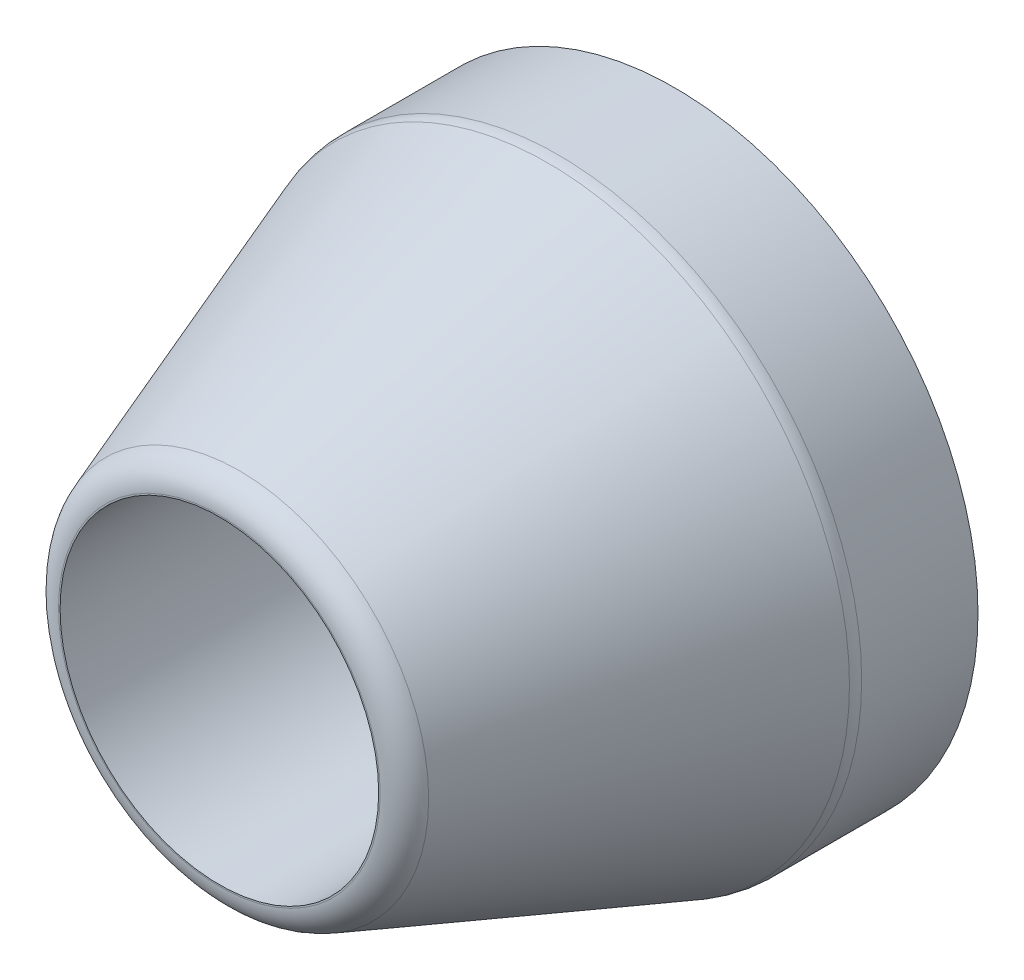
ISO-10303-21;
HEADER;
FILE_DESCRIPTION(('STEP AP214'),'2;1');
FILE_NAME('part.step','',(''),(''),'','','');
FILE_SCHEMA(('AUTOMOTIVE_DESIGN { 1 0 10303 214 1 1 1 1 }'));
ENDSEC;
DATA;
#1=APPLICATION_CONTEXT('core data for automotive mechanical design processes');
#2=APPLICATION_PROTOCOL_DEFINITION('international standard','automotive_design',2000,#1);
#3=PRODUCT_CONTEXT('',#1,'mechanical');
#4=PRODUCT('Part','Part','',(#3));
#5=PRODUCT_RELATED_PRODUCT_CATEGORY('part','',(#4));
#6=PRODUCT_DEFINITION_FORMATION('','',#4);
#7=PRODUCT_DEFINITION_CONTEXT('part definition',#1,'design');
#8=PRODUCT_DEFINITION('design','',#6,#7);
#9=PRODUCT_DEFINITION_SHAPE('','',#8);
#10=(LENGTH_UNIT() NAMED_UNIT(*) SI_UNIT(.MILLI.,.METRE.));
#11=(NAMED_UNIT(*) PLANE_ANGLE_UNIT() SI_UNIT($,.RADIAN.));
#12=(NAMED_UNIT(*) SI_UNIT($,.STERADIAN.) SOLID_ANGLE_UNIT());
#13=UNCERTAINTY_MEASURE_WITH_UNIT(LENGTH_MEASURE(1.E-05),#10,'distance_accuracy_value','');
#14=(GEOMETRIC_REPRESENTATION_CONTEXT(3) GLOBAL_UNCERTAINTY_ASSIGNED_CONTEXT((#13)) GLOBAL_UNIT_ASSIGNED_CONTEXT((#10,
#11,#12)) REPRESENTATION_CONTEXT('',''));
#15=CARTESIAN_POINT('',(0.,0.,0.));
#16=DIRECTION('',(0.,0.,1.));
#17=DIRECTION('',(1.,0.,0.));
#18=AXIS2_PLACEMENT_3D('',#15,#16,#17);
#19=CARTESIAN_POINT('',(0.,0.,0.));
#20=DIRECTION('',(0.,0.,1.));
#21=DIRECTION('',(1.,0.,0.));
#22=AXIS2_PLACEMENT_3D('',#19,#20,#21);
#23=CYLINDRICAL_SURFACE('',#22,2.);
#24=CARTESIAN_POINT('',(0.,0.,2.00000000000002));
#25=DIRECTION('',(0.,0.,1.));
#26=DIRECTION('',(1.,0.,0.));
#27=AXIS2_PLACEMENT_3D('',#24,#25,#26);
#28=CIRCLE('',#27,2.);
#29=CARTESIAN_POINT('',(2.,0.,2.00000000000002));
#30=VERTEX_POINT('',#29);
#31=EDGE_CURVE('E57',#30,#30,#28,.F.);
#32=ORIENTED_EDGE('',*,*,#31,.T.);
#33=EDGE_LOOP('',(#32));
#34=FACE_BOUND('',#33,.T.);
#35=CARTESIAN_POINT('',(0.,0.,7.));
#36=DIRECTION('',(0.,0.,1.));
#37=DIRECTION('',(1.,0.,0.));
#38=AXIS2_PLACEMENT_3D('',#35,#36,#37);
#39=CIRCLE('',#38,2.);
#40=CARTESIAN_POINT('',(2.,0.,7.));
#41=VERTEX_POINT('',#40);
#42=EDGE_CURVE('E64',#41,#41,#39,.F.);
#43=ORIENTED_EDGE('',*,*,#42,.F.);
#44=EDGE_LOOP('',(#43));
#45=FACE_BOUND('',#44,.T.);
#46=ADVANCED_FACE('F37',(#34,#45),#23,.F.);
#47=CARTESIAN_POINT('',(0.,0.,15.));
#48=DIRECTION('',(0.,0.,-1.));
#49=DIRECTION('',(-1.,0.,0.));
#50=AXIS2_PLACEMENT_3D('',#47,#48,#49);
#51=CYLINDRICAL_SURFACE('',#50,10.);
#52=CARTESIAN_POINT('',(0.,0.,3.83376334147306));
#53=DIRECTION('',(0.,0.,1.));
#54=DIRECTION('',(1.,0.,0.));
#55=AXIS2_PLACEMENT_3D('',#52,#53,#54);
#56=CIRCLE('',#55,10.);
#57=CARTESIAN_POINT('',(10.,0.,3.83376334147306));
#58=VERTEX_POINT('',#57);
#59=EDGE_CURVE('E52',#58,#58,#56,.F.);
#60=ORIENTED_EDGE('',*,*,#59,.T.);
#61=EDGE_LOOP('',(#60));
#62=FACE_BOUND('',#61,.T.);
#63=CARTESIAN_POINT('',(0.,0.,0.));
#64=DIRECTION('',(0.,0.,1.));
#65=DIRECTION('',(1.,0.,0.));
#66=AXIS2_PLACEMENT_3D('',#63,#64,#65);
#67=CIRCLE('',#66,10.);
#68=CARTESIAN_POINT('',(10.,0.,0.));
#69=VERTEX_POINT('',#68);
#70=EDGE_CURVE('E63',#69,#69,#67,.T.);
#71=ORIENTED_EDGE('',*,*,#70,.T.);
#72=EDGE_LOOP('',(#71));
#73=FACE_BOUND('',#72,.T.);
#74=ADVANCED_FACE('F89',(#62,#73),#51,.T.);
#75=CARTESIAN_POINT('',(0.,0.,15.));
#76=DIRECTION('',(0.,0.,1.));
#77=DIRECTION('',(1.,0.,0.));
#78=AXIS2_PLACEMENT_3D('',#75,#76,#77);
#79=PLANE('',#78);
#80=CARTESIAN_POINT('',(0.,0.,15.));
#81=DIRECTION('',(0.,0.,1.));
#82=DIRECTION('',(1.,0.,0.));
#83=AXIS2_PLACEMENT_3D('',#80,#81,#82);
#84=CIRCLE('',#83,5.29979246179029);
#85=CARTESIAN_POINT('',(5.29979246179029,0.,15.));
#86=VERTEX_POINT('',#85);
#87=EDGE_CURVE('E10',#86,#86,#84,.T.);
#88=ORIENTED_EDGE('',*,*,#87,.T.);
#89=EDGE_LOOP('',(#88));
#90=FACE_BOUND('',#89,.T.);
#91=CARTESIAN_POINT('',(0.,0.,15.));
#92=DIRECTION('',(0.,0.,1.));
#93=DIRECTION('',(1.,0.,0.));
#94=AXIS2_PLACEMENT_3D('',#91,#92,#93);
#95=CIRCLE('',#94,5.25);
#96=CARTESIAN_POINT('',(5.25,0.,15.));
#97=VERTEX_POINT('',#96);
#98=EDGE_CURVE('E70',#97,#97,#95,.T.);
#99=ORIENTED_EDGE('',*,*,#98,.F.);
#100=EDGE_LOOP('',(#99));
#101=FACE_BOUND('',#100,.T.);
#102=ADVANCED_FACE('F86',(#90,#101),#79,.T.);
#103=CARTESIAN_POINT('',(0.,0.,0.));
#104=DIRECTION('',(0.,0.,1.));
#105=DIRECTION('',(1.,0.,0.));
#106=AXIS2_PLACEMENT_3D('',#103,#104,#105);
#107=PLANE('',#106);
#108=CARTESIAN_POINT('',(0.,0.,0.));
#109=DIRECTION('',(0.,0.,1.));
#110=DIRECTION('',(1.,0.,0.));
#111=AXIS2_PLACEMENT_3D('',#108,#109,#110);
#112=CIRCLE('',#111,4.00000000000001);
#113=CARTESIAN_POINT('',(4.00000000000001,0.,0.));
#114=VERTEX_POINT('',#113);
#115=EDGE_CURVE('E60',#114,#114,#112,.T.);
#116=ORIENTED_EDGE('',*,*,#115,.T.);
#117=EDGE_LOOP('',(#116));
#118=FACE_BOUND('',#117,.T.);
#119=ORIENTED_EDGE('',*,*,#70,.F.);
#120=EDGE_LOOP('',(#119));
#121=FACE_BOUND('',#120,.T.);
#122=ADVANCED_FACE('F88',(#118,#121),#107,.F.);
#123=CARTESIAN_POINT('',(0.,0.,7.));
#124=DIRECTION('',(0.,0.,1.));
#125=DIRECTION('',(1.,0.,0.));
#126=AXIS2_PLACEMENT_3D('',#123,#124,#125);
#127=PLANE('',#126);
#128=CARTESIAN_POINT('',(0.,0.,7.));
#129=DIRECTION('',(0.,0.,1.));
#130=DIRECTION('',(1.,0.,0.));
#131=AXIS2_PLACEMENT_3D('',#128,#129,#130);
#132=CIRCLE('',#131,5.25);
#133=CARTESIAN_POINT('',(5.25,0.,7.));
#134=VERTEX_POINT('',#133);
#135=EDGE_CURVE('E67',#134,#134,#132,.T.);
#136=ORIENTED_EDGE('',*,*,#135,.T.);
#137=EDGE_LOOP('',(#136));
#138=FACE_BOUND('',#137,.T.);
#139=ORIENTED_EDGE('',*,*,#42,.T.);
#140=EDGE_LOOP('',(#139));
#141=FACE_BOUND('',#140,.T.);
#142=ADVANCED_FACE('F76',(#138,#141),#127,.T.);
#143=CARTESIAN_POINT('',(0.,0.,7.));
#144=DIRECTION('',(0.,0.,1.));
#145=DIRECTION('',(1.,0.,0.));
#146=AXIS2_PLACEMENT_3D('',#143,#144,#145);
#147=CYLINDRICAL_SURFACE('',#146,5.25);
#148=ORIENTED_EDGE('',*,*,#135,.F.);
#149=EDGE_LOOP('',(#148));
#150=FACE_BOUND('',#149,.T.);
#151=ORIENTED_EDGE('',*,*,#98,.T.);
#152=EDGE_LOOP('',(#151));
#153=FACE_BOUND('',#152,.T.);
#154=ADVANCED_FACE('F79',(#150,#153),#147,.F.);
#155=CARTESIAN_POINT('',(0.,0.,15.));
#156=DIRECTION('',(0.,0.,-1.));
#157=DIRECTION('',(-1.,0.,0.));
#158=AXIS2_PLACEMENT_3D('',#155,#156,#157);
#159=CONICAL_SURFACE('',#158,6.,0.349065850398867);
#160=CARTESIAN_POINT('',(0.,0.,4.17578348479873));
#161=DIRECTION('',(0.,0.,-1.));
#162=DIRECTION('',(-1.,0.,0.));
#163=AXIS2_PLACEMENT_3D('',#160,#161,#162);
#164=CIRCLE('',#163,9.93969262078591);
#165=CARTESIAN_POINT('',(-9.93969262078591,0.,4.17578348479873));
#166=VERTEX_POINT('',#165);
#167=EDGE_CURVE('E44',#166,#166,#164,.F.);
#168=ORIENTED_EDGE('',*,*,#167,.T.);
#169=EDGE_LOOP('',(#168));
#170=FACE_BOUND('',#169,.T.);
#171=CARTESIAN_POINT('',(0.,0.,14.3420201433257));
#172=DIRECTION('',(0.,0.,1.));
#173=DIRECTION('',(1.,0.,0.));
#174=AXIS2_PLACEMENT_3D('',#171,#172,#173);
#175=CIRCLE('',#174,6.2394850825762);
#176=CARTESIAN_POINT('',(6.2394850825762,0.,14.3420201433257));
#177=VERTEX_POINT('',#176);
#178=EDGE_CURVE('E48',#177,#177,#175,.F.);
#179=ORIENTED_EDGE('',*,*,#178,.T.);
#180=EDGE_LOOP('',(#179));
#181=FACE_BOUND('',#180,.T.);
#182=ADVANCED_FACE('F82',(#170,#181),#159,.T.);
#183=CARTESIAN_POINT('',(0.,0.,0.));
#184=DIRECTION('',(0.,0.,-1.));
#185=DIRECTION('',(-1.,0.,0.));
#186=AXIS2_PLACEMENT_3D('',#183,#184,#185);
#187=CONICAL_SURFACE('',#186,4.00000000000001,0.785398163397446);
#188=ORIENTED_EDGE('',*,*,#31,.F.);
#189=EDGE_LOOP('',(#188));
#190=FACE_BOUND('',#189,.T.);
#191=ORIENTED_EDGE('',*,*,#115,.F.);
#192=EDGE_LOOP('',(#191));
#193=FACE_BOUND('',#192,.T.);
#194=ADVANCED_FACE('F121',(#190,#193),#187,.F.);
#195=CARTESIAN_POINT('',(0.,0.,3.83376334147306));
#196=DIRECTION('',(0.,0.,1.));
#197=DIRECTION('',(1.,0.,0.));
#198=AXIS2_PLACEMENT_3D('',#195,#196,#197);
#199=TOROIDAL_SURFACE('',#198,9.,1.);
#200=ORIENTED_EDGE('',*,*,#167,.F.);
#201=EDGE_LOOP('',(#200));
#202=FACE_BOUND('',#201,.T.);
#203=ORIENTED_EDGE('',*,*,#59,.F.);
#204=EDGE_LOOP('',(#203));
#205=FACE_BOUND('',#204,.T.);
#206=ADVANCED_FACE('F129',(#202,#205),#199,.T.);
#207=CARTESIAN_POINT('',(0.,0.,14.));
#208=DIRECTION('',(0.,0.,1.));
#209=DIRECTION('',(1.,0.,0.));
#210=AXIS2_PLACEMENT_3D('',#207,#208,#209);
#211=TOROIDAL_SURFACE('',#210,5.29979246179029,1.);
#212=ORIENTED_EDGE('',*,*,#178,.F.);
#213=EDGE_LOOP('',(#212));
#214=FACE_BOUND('',#213,.T.);
#215=ORIENTED_EDGE('',*,*,#87,.F.);
#216=EDGE_LOOP('',(#215));
#217=FACE_BOUND('',#216,.T.);
#218=ADVANCED_FACE('F39',(#214,#217),#211,.T.);
#219=CLOSED_SHELL('',(#46,#74,#102,#122,#142,#154,#182,#194,#206,#218));
#220=MANIFOLD_SOLID_BREP('B2',#219);
#221=ADVANCED_BREP_SHAPE_REPRESENTATION('',(#18,#220),#14);
#222=SHAPE_DEFINITION_REPRESENTATION(#9,#221);
ENDSEC;
END-ISO-10303-21;
